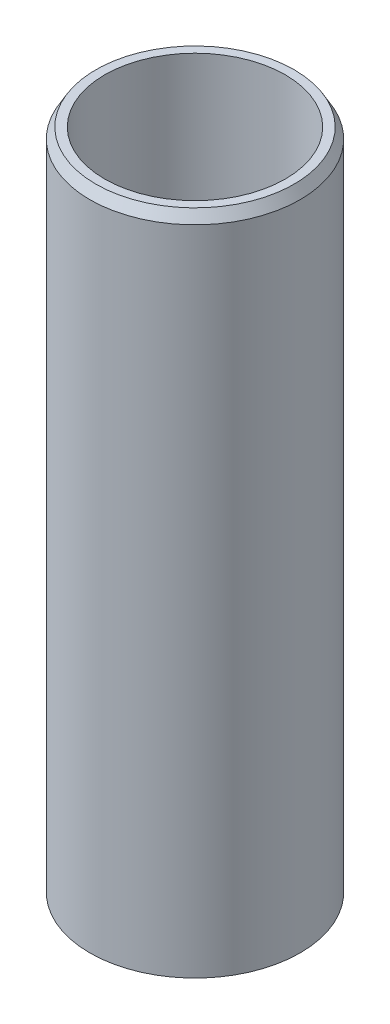
ISO-10303-21;
HEADER;
FILE_DESCRIPTION(('STEP AP214'),'2;1');
FILE_NAME('part.step','',(''),(''),'','','');
FILE_SCHEMA(('AUTOMOTIVE_DESIGN { 1 0 10303 214 1 1 1 1 }'));
ENDSEC;
DATA;
#1=APPLICATION_CONTEXT('core data for automotive mechanical design processes');
#2=APPLICATION_PROTOCOL_DEFINITION('international standard','automotive_design',2000,#1);
#3=PRODUCT_CONTEXT('',#1,'mechanical');
#4=PRODUCT('Part','Part','',(#3));
#5=PRODUCT_RELATED_PRODUCT_CATEGORY('part','',(#4));
#6=PRODUCT_DEFINITION_FORMATION('','',#4);
#7=PRODUCT_DEFINITION_CONTEXT('part definition',#1,'design');
#8=PRODUCT_DEFINITION('design','',#6,#7);
#9=PRODUCT_DEFINITION_SHAPE('','',#8);
#10=(LENGTH_UNIT() NAMED_UNIT(*) SI_UNIT(.MILLI.,.METRE.));
#11=(NAMED_UNIT(*) PLANE_ANGLE_UNIT() SI_UNIT($,.RADIAN.));
#12=(NAMED_UNIT(*) SI_UNIT($,.STERADIAN.) SOLID_ANGLE_UNIT());
#13=UNCERTAINTY_MEASURE_WITH_UNIT(LENGTH_MEASURE(1.E-05),#10,'distance_accuracy_value','');
#14=(GEOMETRIC_REPRESENTATION_CONTEXT(3) GLOBAL_UNCERTAINTY_ASSIGNED_CONTEXT((#13)) GLOBAL_UNIT_ASSIGNED_CONTEXT((#10,
#11,#12)) REPRESENTATION_CONTEXT('',''));
#15=CARTESIAN_POINT('',(0.,0.,0.));
#16=DIRECTION('',(0.,0.,1.));
#17=DIRECTION('',(1.,0.,0.));
#18=AXIS2_PLACEMENT_3D('',#15,#16,#17);
#19=CARTESIAN_POINT('',(0.,365.651841690088,0.));
#20=DIRECTION('',(0.,-1.,0.));
#21=DIRECTION('',(0.,0.,-1.));
#22=AXIS2_PLACEMENT_3D('',#19,#20,#21);
#23=CYLINDRICAL_SURFACE('',#22,57.5);
#24=CARTESIAN_POINT('',(0.,359.946163754669,0.));
#25=DIRECTION('',(0.,1.,0.));
#26=DIRECTION('',(0.,0.,1.));
#27=AXIS2_PLACEMENT_3D('',#24,#25,#26);
#28=CIRCLE('',#27,57.5);
#29=CARTESIAN_POINT('',(0.,359.946163754669,57.5));
#30=VERTEX_POINT('',#29);
#31=EDGE_CURVE('E50',#30,#30,#28,.F.);
#32=ORIENTED_EDGE('',*,*,#31,.T.);
#33=EDGE_LOOP('',(#32));
#34=FACE_BOUND('',#33,.T.);
#35=CARTESIAN_POINT('',(0.,3.29417469192361,0.));
#36=DIRECTION('',(0.,1.,0.));
#37=DIRECTION('',(0.,0.,1.));
#38=AXIS2_PLACEMENT_3D('',#35,#36,#37);
#39=CIRCLE('',#38,57.5);
#40=CARTESIAN_POINT('',(0.,3.29417469192361,57.5));
#41=VERTEX_POINT('',#40);
#42=EDGE_CURVE('E51',#41,#41,#39,.T.);
#43=ORIENTED_EDGE('',*,*,#42,.T.);
#44=EDGE_LOOP('',(#43));
#45=FACE_BOUND('',#44,.T.);
#46=ADVANCED_FACE('F39',(#34,#45),#23,.T.);
#47=CARTESIAN_POINT('',(0.,365.651841690088,0.));
#48=DIRECTION('',(0.,1.,0.));
#49=DIRECTION('',(0.,0.,1.));
#50=AXIS2_PLACEMENT_3D('',#47,#48,#49);
#51=PLANE('',#50);
#52=CARTESIAN_POINT('',(0.,365.651841690088,0.));
#53=DIRECTION('',(0.,1.,0.));
#54=DIRECTION('',(0.,0.,1.));
#55=AXIS2_PLACEMENT_3D('',#52,#53,#54);
#56=CIRCLE('',#55,54.2058253080764);
#57=CARTESIAN_POINT('',(0.,365.651841690088,54.2058253080764));
#58=VERTEX_POINT('',#57);
#59=EDGE_CURVE('E54',#58,#58,#56,.T.);
#60=ORIENTED_EDGE('',*,*,#59,.T.);
#61=EDGE_LOOP('',(#60));
#62=FACE_BOUND('',#61,.T.);
#63=CARTESIAN_POINT('',(0.,365.651841690088,0.));
#64=DIRECTION('',(0.,1.,0.));
#65=DIRECTION('',(0.,0.,1.));
#66=AXIS2_PLACEMENT_3D('',#63,#64,#65);
#67=CIRCLE('',#66,49.3757336449258);
#68=CARTESIAN_POINT('',(0.,365.651841690088,49.3757336449258));
#69=VERTEX_POINT('',#68);
#70=EDGE_CURVE('E58',#69,#69,#67,.T.);
#71=ORIENTED_EDGE('',*,*,#70,.F.);
#72=EDGE_LOOP('',(#71));
#73=FACE_BOUND('',#72,.T.);
#74=ADVANCED_FACE('F69',(#62,#73),#51,.T.);
#75=CARTESIAN_POINT('',(0.,0.,0.));
#76=DIRECTION('',(0.,1.,0.));
#77=DIRECTION('',(0.,0.,1.));
#78=AXIS2_PLACEMENT_3D('',#75,#76,#77);
#79=PLANE('',#78);
#80=CARTESIAN_POINT('',(0.,0.,0.));
#81=DIRECTION('',(0.,1.,0.));
#82=DIRECTION('',(0.,0.,1.));
#83=AXIS2_PLACEMENT_3D('',#80,#81,#82);
#84=CIRCLE('',#83,51.7943220645807);
#85=CARTESIAN_POINT('',(0.,0.,51.7943220645807));
#86=VERTEX_POINT('',#85);
#87=EDGE_CURVE('E10',#86,#86,#84,.F.);
#88=ORIENTED_EDGE('',*,*,#87,.T.);
#89=EDGE_LOOP('',(#88));
#90=FACE_BOUND('',#89,.T.);
#91=CARTESIAN_POINT('',(0.,0.,0.));
#92=DIRECTION('',(0.,1.,0.));
#93=DIRECTION('',(0.,0.,1.));
#94=AXIS2_PLACEMENT_3D('',#91,#92,#93);
#95=CIRCLE('',#94,49.3757336449258);
#96=CARTESIAN_POINT('',(0.,0.,49.3757336449258));
#97=VERTEX_POINT('',#96);
#98=EDGE_CURVE('E63',#97,#97,#95,.T.);
#99=ORIENTED_EDGE('',*,*,#98,.T.);
#100=EDGE_LOOP('',(#99));
#101=FACE_BOUND('',#100,.T.);
#102=ADVANCED_FACE('F75',(#90,#101),#79,.F.);
#103=CARTESIAN_POINT('',(0.,365.651841690088,0.));
#104=DIRECTION('',(0.,-1.,0.));
#105=DIRECTION('',(0.,0.,-1.));
#106=AXIS2_PLACEMENT_3D('',#103,#104,#105);
#107=CYLINDRICAL_SURFACE('',#106,49.3757336449258);
#108=ORIENTED_EDGE('',*,*,#70,.T.);
#109=EDGE_LOOP('',(#108));
#110=FACE_BOUND('',#109,.T.);
#111=ORIENTED_EDGE('',*,*,#98,.F.);
#112=EDGE_LOOP('',(#111));
#113=FACE_BOUND('',#112,.T.);
#114=ADVANCED_FACE('F70',(#110,#113),#107,.F.);
#115=CARTESIAN_POINT('',(0.,365.651841690088,0.));
#116=DIRECTION('',(0.,-1.,0.));
#117=DIRECTION('',(0.,0.,-1.));
#118=AXIS2_PLACEMENT_3D('',#115,#116,#117);
#119=CONICAL_SURFACE('',#118,54.2058253080764,0.523598775598296);
#120=ORIENTED_EDGE('',*,*,#31,.F.);
#121=EDGE_LOOP('',(#120));
#122=FACE_BOUND('',#121,.T.);
#123=ORIENTED_EDGE('',*,*,#59,.F.);
#124=EDGE_LOOP('',(#123));
#125=FACE_BOUND('',#124,.T.);
#126=ADVANCED_FACE('F81',(#122,#125),#119,.T.);
#127=CARTESIAN_POINT('',(0.,3.29417469192361,0.));
#128=DIRECTION('',(0.,1.,0.));
#129=DIRECTION('',(0.,0.,1.));
#130=AXIS2_PLACEMENT_3D('',#127,#128,#129);
#131=CONICAL_SURFACE('',#130,57.5,1.0471975511966);
#132=ORIENTED_EDGE('',*,*,#87,.F.);
#133=EDGE_LOOP('',(#132));
#134=FACE_BOUND('',#133,.T.);
#135=ORIENTED_EDGE('',*,*,#42,.F.);
#136=EDGE_LOOP('',(#135));
#137=FACE_BOUND('',#136,.T.);
#138=ADVANCED_FACE('F45',(#134,#137),#131,.T.);
#139=CLOSED_SHELL('',(#46,#74,#102,#114,#126,#138));
#140=MANIFOLD_SOLID_BREP('B2',#139);
#141=ADVANCED_BREP_SHAPE_REPRESENTATION('',(#18,#140),#14);
#142=SHAPE_DEFINITION_REPRESENTATION(#9,#141);
ENDSEC;
END-ISO-10303-21;
